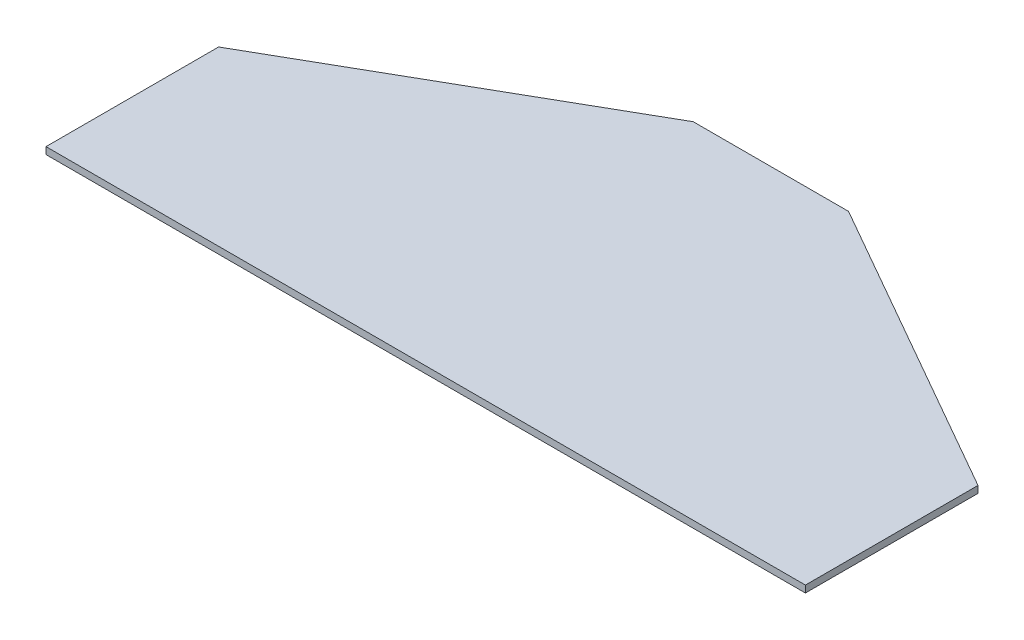
ISO-10303-21;
HEADER;
FILE_DESCRIPTION(('STEP AP214'),'2;1');
FILE_NAME('part.step','',(''),(''),'','','');
FILE_SCHEMA(('AUTOMOTIVE_DESIGN { 1 0 10303 214 1 1 1 1 }'));
ENDSEC;
DATA;
#1=APPLICATION_CONTEXT('core data for automotive mechanical design processes');
#2=APPLICATION_PROTOCOL_DEFINITION('international standard','automotive_design',2000,#1);
#3=PRODUCT_CONTEXT('',#1,'mechanical');
#4=PRODUCT('Part','Part','',(#3));
#5=PRODUCT_RELATED_PRODUCT_CATEGORY('part','',(#4));
#6=PRODUCT_DEFINITION_FORMATION('','',#4);
#7=PRODUCT_DEFINITION_CONTEXT('part definition',#1,'design');
#8=PRODUCT_DEFINITION('design','',#6,#7);
#9=PRODUCT_DEFINITION_SHAPE('','',#8);
#10=(LENGTH_UNIT() NAMED_UNIT(*) SI_UNIT(.MILLI.,.METRE.));
#11=(NAMED_UNIT(*) PLANE_ANGLE_UNIT() SI_UNIT($,.RADIAN.));
#12=(NAMED_UNIT(*) SI_UNIT($,.STERADIAN.) SOLID_ANGLE_UNIT());
#13=UNCERTAINTY_MEASURE_WITH_UNIT(LENGTH_MEASURE(1.E-05),#10,'distance_accuracy_value','');
#14=(GEOMETRIC_REPRESENTATION_CONTEXT(3) GLOBAL_UNCERTAINTY_ASSIGNED_CONTEXT((#13)) GLOBAL_UNIT_ASSIGNED_CONTEXT((#10,
#11,#12)) REPRESENTATION_CONTEXT('',''));
#15=CARTESIAN_POINT('',(0.,0.,0.));
#16=DIRECTION('',(0.,0.,1.));
#17=DIRECTION('',(1.,0.,0.));
#18=AXIS2_PLACEMENT_3D('',#15,#16,#17);
#19=CARTESIAN_POINT('',(-139.7,2.54,-63.5));
#20=DIRECTION('',(1.,0.,0.));
#21=DIRECTION('',(0.,0.,-1.));
#22=AXIS2_PLACEMENT_3D('',#19,#20,#21);
#23=PLANE('',#22);
#24=DIRECTION('',(0.,0.,1.));
#25=VECTOR('',#24,1.);
#26=CARTESIAN_POINT('',(-139.7,0.,-63.5));
#27=LINE('',#26,#25);
#28=CARTESIAN_POINT('',(-139.7,0.,-63.5));
#29=VERTEX_POINT('',#28);
#30=CARTESIAN_POINT('',(-139.7,0.,0.));
#31=VERTEX_POINT('',#30);
#32=EDGE_CURVE('E119',#29,#31,#27,.T.);
#33=ORIENTED_EDGE('',*,*,#32,.T.);
#34=DIRECTION('',(0.,-1.,0.));
#35=VECTOR('',#34,1.);
#36=CARTESIAN_POINT('',(-139.7,2.54,0.));
#37=LINE('',#36,#35);
#38=CARTESIAN_POINT('',(-139.7,2.54,0.));
#39=VERTEX_POINT('',#38);
#40=EDGE_CURVE('E11',#39,#31,#37,.T.);
#41=ORIENTED_EDGE('',*,*,#40,.F.);
#42=DIRECTION('',(0.,0.,1.));
#43=VECTOR('',#42,1.);
#44=CARTESIAN_POINT('',(-139.7,2.54,-63.5));
#45=LINE('',#44,#43);
#46=CARTESIAN_POINT('',(-139.7,2.54,-63.5));
#47=VERTEX_POINT('',#46);
#48=EDGE_CURVE('E129',#47,#39,#45,.T.);
#49=ORIENTED_EDGE('',*,*,#48,.F.);
#50=DIRECTION('',(0.,-1.,0.));
#51=VECTOR('',#50,1.);
#52=CARTESIAN_POINT('',(-139.7,2.54,-63.5));
#53=LINE('',#52,#51);
#54=EDGE_CURVE('E115',#47,#29,#53,.T.);
#55=ORIENTED_EDGE('',*,*,#54,.T.);
#56=EDGE_LOOP('',(#33,#41,#49,#55));
#57=FACE_BOUND('',#56,.T.);
#58=ADVANCED_FACE('F35',(#57),#23,.F.);
#59=CARTESIAN_POINT('',(-139.7,2.54,0.));
#60=DIRECTION('',(0.,0.,-1.));
#61=DIRECTION('',(-1.,0.,0.));
#62=AXIS2_PLACEMENT_3D('',#59,#60,#61);
#63=PLANE('',#62);
#64=DIRECTION('',(1.,0.,0.));
#65=VECTOR('',#64,1.);
#66=CARTESIAN_POINT('',(-139.7,0.,0.));
#67=LINE('',#66,#65);
#68=CARTESIAN_POINT('',(139.7,0.,0.));
#69=VERTEX_POINT('',#68);
#70=EDGE_CURVE('E122',#31,#69,#67,.T.);
#71=ORIENTED_EDGE('',*,*,#70,.T.);
#72=DIRECTION('',(0.,-1.,0.));
#73=VECTOR('',#72,1.);
#74=CARTESIAN_POINT('',(139.7,2.54,0.));
#75=LINE('',#74,#73);
#76=CARTESIAN_POINT('',(139.7,2.54,0.));
#77=VERTEX_POINT('',#76);
#78=EDGE_CURVE('E43',#77,#69,#75,.T.);
#79=ORIENTED_EDGE('',*,*,#78,.F.);
#80=DIRECTION('',(1.,0.,0.));
#81=VECTOR('',#80,1.);
#82=CARTESIAN_POINT('',(-139.7,2.54,0.));
#83=LINE('',#82,#81);
#84=EDGE_CURVE('E88',#39,#77,#83,.T.);
#85=ORIENTED_EDGE('',*,*,#84,.F.);
#86=ORIENTED_EDGE('',*,*,#40,.T.);
#87=EDGE_LOOP('',(#71,#79,#85,#86));
#88=FACE_BOUND('',#87,.T.);
#89=ADVANCED_FACE('F153',(#88),#63,.F.);
#90=CARTESIAN_POINT('',(139.7,2.54,0.));
#91=DIRECTION('',(-1.,0.,0.));
#92=DIRECTION('',(0.,0.,1.));
#93=AXIS2_PLACEMENT_3D('',#90,#91,#92);
#94=PLANE('',#93);
#95=DIRECTION('',(0.,0.,-1.));
#96=VECTOR('',#95,1.);
#97=CARTESIAN_POINT('',(139.7,0.,0.));
#98=LINE('',#97,#96);
#99=CARTESIAN_POINT('',(139.7,0.,-63.5000000000001));
#100=VERTEX_POINT('',#99);
#101=EDGE_CURVE('E124',#69,#100,#98,.T.);
#102=ORIENTED_EDGE('',*,*,#101,.T.);
#103=DIRECTION('',(0.,-1.,0.));
#104=VECTOR('',#103,1.);
#105=CARTESIAN_POINT('',(139.7,2.54,-63.5000000000001));
#106=LINE('',#105,#104);
#107=CARTESIAN_POINT('',(139.7,2.54,-63.5000000000001));
#108=VERTEX_POINT('',#107);
#109=EDGE_CURVE('E110',#108,#100,#106,.T.);
#110=ORIENTED_EDGE('',*,*,#109,.F.);
#111=DIRECTION('',(0.,0.,-1.));
#112=VECTOR('',#111,1.);
#113=CARTESIAN_POINT('',(139.7,2.54,0.));
#114=LINE('',#113,#112);
#115=EDGE_CURVE('E101',#77,#108,#114,.T.);
#116=ORIENTED_EDGE('',*,*,#115,.F.);
#117=ORIENTED_EDGE('',*,*,#78,.T.);
#118=EDGE_LOOP('',(#102,#110,#116,#117));
#119=FACE_BOUND('',#118,.T.);
#120=ADVANCED_FACE('F135',(#119),#94,.F.);
#121=CARTESIAN_POINT('',(139.7,2.54,-63.5000000000001));
#122=DIRECTION('',(-0.496138938356833,0.,0.86824314212446));
#123=DIRECTION('',(0.86824314212446,0.,0.496138938356833));
#124=AXIS2_PLACEMENT_3D('',#121,#122,#123);
#125=PLANE('',#124);
#126=DIRECTION('',(-0.86824314212446,0.,-0.496138938356833));
#127=VECTOR('',#126,1.);
#128=CARTESIAN_POINT('',(139.7,0.,-63.5000000000001));
#129=LINE('',#128,#127);
#130=CARTESIAN_POINT('',(28.575,0.,-127.));
#131=VERTEX_POINT('',#130);
#132=EDGE_CURVE('E109',#100,#131,#129,.T.);
#133=ORIENTED_EDGE('',*,*,#132,.T.);
#134=DIRECTION('',(0.,-1.,0.));
#135=VECTOR('',#134,1.);
#136=CARTESIAN_POINT('',(28.575,2.54,-127.));
#137=LINE('',#136,#135);
#138=CARTESIAN_POINT('',(28.575,2.54,-127.));
#139=VERTEX_POINT('',#138);
#140=EDGE_CURVE('E106',#139,#131,#137,.T.);
#141=ORIENTED_EDGE('',*,*,#140,.F.);
#142=DIRECTION('',(-0.86824314212446,0.,-0.496138938356833));
#143=VECTOR('',#142,1.);
#144=CARTESIAN_POINT('',(139.7,2.54,-63.5000000000001));
#145=LINE('',#144,#143);
#146=EDGE_CURVE('E95',#108,#139,#145,.T.);
#147=ORIENTED_EDGE('',*,*,#146,.F.);
#148=ORIENTED_EDGE('',*,*,#109,.T.);
#149=EDGE_LOOP('',(#133,#141,#147,#148));
#150=FACE_BOUND('',#149,.T.);
#151=ADVANCED_FACE('F107',(#150),#125,.F.);
#152=CARTESIAN_POINT('',(28.575,2.54,-127.));
#153=DIRECTION('',(0.,0.,1.));
#154=DIRECTION('',(1.,0.,0.));
#155=AXIS2_PLACEMENT_3D('',#152,#153,#154);
#156=PLANE('',#155);
#157=DIRECTION('',(-1.,0.,0.));
#158=VECTOR('',#157,1.);
#159=CARTESIAN_POINT('',(28.575,0.,-127.));
#160=LINE('',#159,#158);
#161=CARTESIAN_POINT('',(-28.575,0.,-127.));
#162=VERTEX_POINT('',#161);
#163=EDGE_CURVE('E74',#131,#162,#160,.T.);
#164=ORIENTED_EDGE('',*,*,#163,.T.);
#165=DIRECTION('',(0.,-1.,0.));
#166=VECTOR('',#165,1.);
#167=CARTESIAN_POINT('',(-28.575,2.54,-127.));
#168=LINE('',#167,#166);
#169=CARTESIAN_POINT('',(-28.575,2.54,-127.));
#170=VERTEX_POINT('',#169);
#171=EDGE_CURVE('E111',#170,#162,#168,.T.);
#172=ORIENTED_EDGE('',*,*,#171,.F.);
#173=DIRECTION('',(-1.,0.,0.));
#174=VECTOR('',#173,1.);
#175=CARTESIAN_POINT('',(28.575,2.54,-127.));
#176=LINE('',#175,#174);
#177=EDGE_CURVE('E99',#139,#170,#176,.T.);
#178=ORIENTED_EDGE('',*,*,#177,.F.);
#179=ORIENTED_EDGE('',*,*,#140,.T.);
#180=EDGE_LOOP('',(#164,#172,#178,#179));
#181=FACE_BOUND('',#180,.T.);
#182=ADVANCED_FACE('F113',(#181),#156,.F.);
#183=CARTESIAN_POINT('',(-28.575,2.54,-127.));
#184=DIRECTION('',(0.496138938356834,0.,0.868243142124459));
#185=DIRECTION('',(0.868243142124459,0.,-0.496138938356834));
#186=AXIS2_PLACEMENT_3D('',#183,#184,#185);
#187=PLANE('',#186);
#188=DIRECTION('',(-0.868243142124459,0.,0.496138938356834));
#189=VECTOR('',#188,1.);
#190=CARTESIAN_POINT('',(-28.575,0.,-127.));
#191=LINE('',#190,#189);
#192=EDGE_CURVE('E80',#162,#29,#191,.T.);
#193=ORIENTED_EDGE('',*,*,#192,.T.);
#194=ORIENTED_EDGE('',*,*,#54,.F.);
#195=DIRECTION('',(-0.868243142124459,0.,0.496138938356834));
#196=VECTOR('',#195,1.);
#197=CARTESIAN_POINT('',(-28.575,2.54,-127.));
#198=LINE('',#197,#196);
#199=EDGE_CURVE('E51',#170,#47,#198,.T.);
#200=ORIENTED_EDGE('',*,*,#199,.F.);
#201=ORIENTED_EDGE('',*,*,#171,.T.);
#202=EDGE_LOOP('',(#193,#194,#200,#201));
#203=FACE_BOUND('',#202,.T.);
#204=ADVANCED_FACE('F142',(#203),#187,.F.);
#205=CARTESIAN_POINT('',(0.,2.54,0.));
#206=DIRECTION('',(0.,1.,0.));
#207=DIRECTION('',(0.,0.,1.));
#208=AXIS2_PLACEMENT_3D('',#205,#206,#207);
#209=PLANE('',#208);
#210=ORIENTED_EDGE('',*,*,#48,.T.);
#211=ORIENTED_EDGE('',*,*,#84,.T.);
#212=ORIENTED_EDGE('',*,*,#115,.T.);
#213=ORIENTED_EDGE('',*,*,#146,.T.);
#214=ORIENTED_EDGE('',*,*,#177,.T.);
#215=ORIENTED_EDGE('',*,*,#199,.T.);
#216=EDGE_LOOP('',(#210,#211,#212,#213,#214,#215));
#217=FACE_BOUND('',#216,.T.);
#218=ADVANCED_FACE('F97',(#217),#209,.T.);
#219=CARTESIAN_POINT('',(0.,0.,0.));
#220=DIRECTION('',(0.,1.,0.));
#221=DIRECTION('',(0.,0.,1.));
#222=AXIS2_PLACEMENT_3D('',#219,#220,#221);
#223=PLANE('',#222);
#224=ORIENTED_EDGE('',*,*,#32,.F.);
#225=ORIENTED_EDGE('',*,*,#192,.F.);
#226=ORIENTED_EDGE('',*,*,#163,.F.);
#227=ORIENTED_EDGE('',*,*,#132,.F.);
#228=ORIENTED_EDGE('',*,*,#101,.F.);
#229=ORIENTED_EDGE('',*,*,#70,.F.);
#230=EDGE_LOOP('',(#224,#225,#226,#227,#228,#229));
#231=FACE_BOUND('',#230,.T.);
#232=ADVANCED_FACE('F138',(#231),#223,.F.);
#233=CLOSED_SHELL('',(#58,#89,#120,#151,#182,#204,#218,#232));
#234=MANIFOLD_SOLID_BREP('B2',#233);
#235=ADVANCED_BREP_SHAPE_REPRESENTATION('',(#18,#234),#14);
#236=SHAPE_DEFINITION_REPRESENTATION(#9,#235);
ENDSEC;
END-ISO-10303-21;
